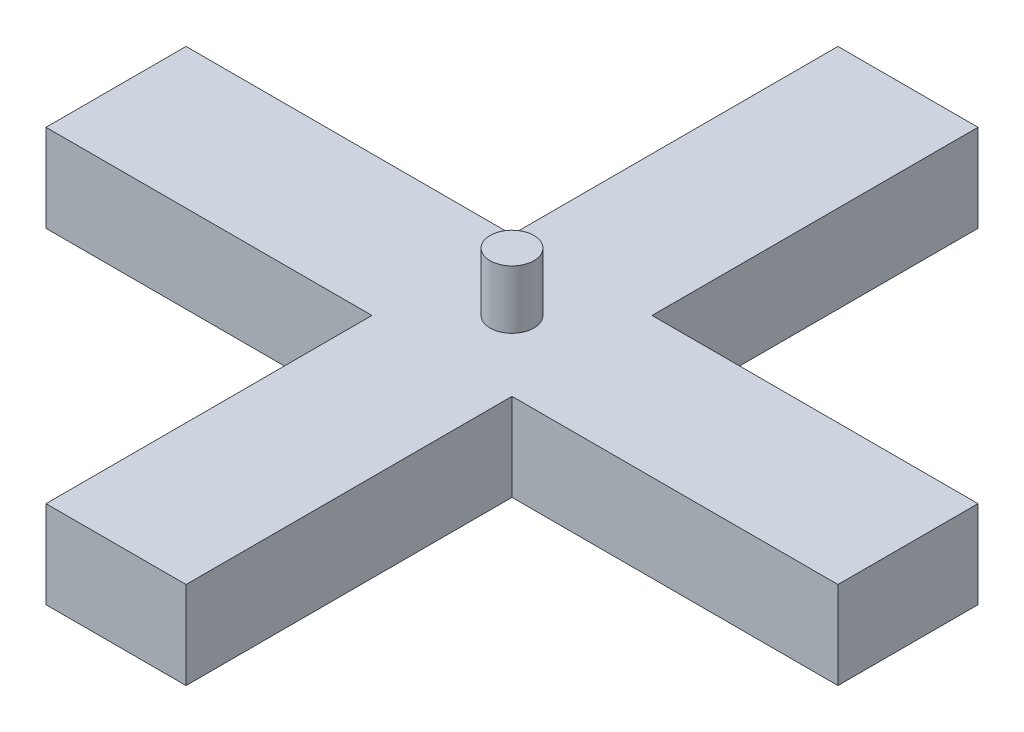
ISO-10303-21;
HEADER;
FILE_DESCRIPTION(('STEP AP214'),'2;1');
FILE_NAME('part.step','',(''),(''),'','','');
FILE_SCHEMA(('AUTOMOTIVE_DESIGN { 1 0 10303 214 1 1 1 1 }'));
ENDSEC;
DATA;
#1=APPLICATION_CONTEXT('core data for automotive mechanical design processes');
#2=APPLICATION_PROTOCOL_DEFINITION('international standard','automotive_design',2000,#1);
#3=PRODUCT_CONTEXT('',#1,'mechanical');
#4=PRODUCT('Part','Part','',(#3));
#5=PRODUCT_RELATED_PRODUCT_CATEGORY('part','',(#4));
#6=PRODUCT_DEFINITION_FORMATION('','',#4);
#7=PRODUCT_DEFINITION_CONTEXT('part definition',#1,'design');
#8=PRODUCT_DEFINITION('design','',#6,#7);
#9=PRODUCT_DEFINITION_SHAPE('','',#8);
#10=(LENGTH_UNIT() NAMED_UNIT(*) SI_UNIT(.MILLI.,.METRE.));
#11=(NAMED_UNIT(*) PLANE_ANGLE_UNIT() SI_UNIT($,.RADIAN.));
#12=(NAMED_UNIT(*) SI_UNIT($,.STERADIAN.) SOLID_ANGLE_UNIT());
#13=UNCERTAINTY_MEASURE_WITH_UNIT(LENGTH_MEASURE(1.E-05),#10,'distance_accuracy_value','');
#14=(GEOMETRIC_REPRESENTATION_CONTEXT(3) GLOBAL_UNCERTAINTY_ASSIGNED_CONTEXT((#13)) GLOBAL_UNIT_ASSIGNED_CONTEXT((#10,
#11,#12)) REPRESENTATION_CONTEXT('',''));
#15=CARTESIAN_POINT('',(0.,0.,0.));
#16=DIRECTION('',(0.,0.,1.));
#17=DIRECTION('',(1.,0.,0.));
#18=AXIS2_PLACEMENT_3D('',#15,#16,#17);
#19=CARTESIAN_POINT('',(-2.40562015503876,5.,5.51972868217054));
#20=DIRECTION('',(0.,-1.,0.));
#21=DIRECTION('',(0.,0.,-1.));
#22=AXIS2_PLACEMENT_3D('',#19,#20,#21);
#23=CYLINDRICAL_SURFACE('',#22,0.75);
#24=CARTESIAN_POINT('',(-2.40562015503876,3.,5.51972868217054));
#25=DIRECTION('',(0.,1.,0.));
#26=DIRECTION('',(0.,0.,1.));
#27=AXIS2_PLACEMENT_3D('',#24,#25,#26);
#28=CIRCLE('',#27,0.75);
#29=CARTESIAN_POINT('',(-2.40562015503876,3.,6.26972868217054));
#30=VERTEX_POINT('',#29);
#31=EDGE_CURVE('E155',#30,#30,#28,.T.);
#32=ORIENTED_EDGE('',*,*,#31,.T.);
#33=EDGE_LOOP('',(#32));
#34=FACE_BOUND('',#33,.T.);
#35=CARTESIAN_POINT('',(-2.40562015503876,5.,5.51972868217054));
#36=DIRECTION('',(0.,1.,0.));
#37=DIRECTION('',(0.,0.,1.));
#38=AXIS2_PLACEMENT_3D('',#35,#36,#37);
#39=CIRCLE('',#38,0.75);
#40=CARTESIAN_POINT('',(-2.40562015503876,5.,6.26972868217054));
#41=VERTEX_POINT('',#40);
#42=EDGE_CURVE('E11',#41,#41,#39,.T.);
#43=ORIENTED_EDGE('',*,*,#42,.F.);
#44=EDGE_LOOP('',(#43));
#45=FACE_BOUND('',#44,.T.);
#46=ADVANCED_FACE('F39',(#34,#45),#23,.T.);
#47=CARTESIAN_POINT('',(0.,5.,0.));
#48=DIRECTION('',(0.,1.,0.));
#49=DIRECTION('',(0.,0.,1.));
#50=AXIS2_PLACEMENT_3D('',#47,#48,#49);
#51=PLANE('',#50);
#52=ORIENTED_EDGE('',*,*,#42,.T.);
#53=EDGE_LOOP('',(#52));
#54=FACE_BOUND('',#53,.T.);
#55=ADVANCED_FACE('F220',(#54),#51,.T.);
#56=CARTESIAN_POINT('',(0.,3.,7.91972868217033));
#57=DIRECTION('',(0.,0.,1.));
#58=DIRECTION('',(1.,0.,0.));
#59=AXIS2_PLACEMENT_3D('',#56,#57,#58);
#60=PLANE('',#59);
#61=DIRECTION('',(-1.,0.,0.));
#62=VECTOR('',#61,1.);
#63=CARTESIAN_POINT('',(0.,0.,7.91972868217033));
#64=LINE('',#63,#62);
#65=CARTESIAN_POINT('',(-4.80562015503876,0.,7.91972868217032));
#66=VERTEX_POINT('',#65);
#67=CARTESIAN_POINT('',(-15.9756201550386,0.,7.91972868217028));
#68=VERTEX_POINT('',#67);
#69=EDGE_CURVE('E161',#66,#68,#64,.T.);
#70=ORIENTED_EDGE('',*,*,#69,.F.);
#71=DIRECTION('',(0.,-1.,0.));
#72=VECTOR('',#71,1.);
#73=CARTESIAN_POINT('',(-4.80562015503876,3.,7.91972868217032));
#74=LINE('',#73,#72);
#75=CARTESIAN_POINT('',(-4.80562015503876,3.,7.91972868217032));
#76=VERTEX_POINT('',#75);
#77=EDGE_CURVE('E47',#76,#66,#74,.T.);
#78=ORIENTED_EDGE('',*,*,#77,.F.);
#79=DIRECTION('',(-1.,0.,0.));
#80=VECTOR('',#79,1.);
#81=CARTESIAN_POINT('',(0.,3.,7.91972868217033));
#82=LINE('',#81,#80);
#83=CARTESIAN_POINT('',(-15.9756201550386,3.,7.91972868217028));
#84=VERTEX_POINT('',#83);
#85=EDGE_CURVE('E191',#76,#84,#82,.T.);
#86=ORIENTED_EDGE('',*,*,#85,.T.);
#87=DIRECTION('',(0.,-1.,0.));
#88=VECTOR('',#87,1.);
#89=CARTESIAN_POINT('',(-15.9756201550386,3.,7.91972868217028));
#90=LINE('',#89,#88);
#91=EDGE_CURVE('E103',#84,#68,#90,.T.);
#92=ORIENTED_EDGE('',*,*,#91,.T.);
#93=EDGE_LOOP('',(#70,#78,#86,#92));
#94=FACE_BOUND('',#93,.T.);
#95=ADVANCED_FACE('F218',(#94),#60,.T.);
#96=CARTESIAN_POINT('',(-4.80562015503876,3.,0.));
#97=DIRECTION('',(1.,0.,0.));
#98=DIRECTION('',(0.,0.,-1.));
#99=AXIS2_PLACEMENT_3D('',#96,#97,#98);
#100=PLANE('',#99);
#101=DIRECTION('',(0.,0.,1.));
#102=VECTOR('',#101,1.);
#103=CARTESIAN_POINT('',(-4.80562015503876,0.,0.));
#104=LINE('',#103,#102);
#105=CARTESIAN_POINT('',(-4.80562015503876,0.,19.0897286821705));
#106=VERTEX_POINT('',#105);
#107=EDGE_CURVE('E164',#66,#106,#104,.T.);
#108=ORIENTED_EDGE('',*,*,#107,.T.);
#109=DIRECTION('',(0.,-1.,0.));
#110=VECTOR('',#109,1.);
#111=CARTESIAN_POINT('',(-4.80562015503876,3.,19.0897286821705));
#112=LINE('',#111,#110);
#113=CARTESIAN_POINT('',(-4.80562015503876,3.,19.0897286821705));
#114=VERTEX_POINT('',#113);
#115=EDGE_CURVE('E207',#114,#106,#112,.T.);
#116=ORIENTED_EDGE('',*,*,#115,.F.);
#117=DIRECTION('',(0.,0.,1.));
#118=VECTOR('',#117,1.);
#119=CARTESIAN_POINT('',(-4.80562015503876,3.,0.));
#120=LINE('',#119,#118);
#121=EDGE_CURVE('E213',#76,#114,#120,.T.);
#122=ORIENTED_EDGE('',*,*,#121,.F.);
#123=ORIENTED_EDGE('',*,*,#77,.T.);
#124=EDGE_LOOP('',(#108,#116,#122,#123));
#125=FACE_BOUND('',#124,.T.);
#126=ADVANCED_FACE('F211',(#125),#100,.F.);
#127=CARTESIAN_POINT('',(0.,3.,19.0897286821705));
#128=DIRECTION('',(0.,0.,-1.));
#129=DIRECTION('',(-1.,0.,0.));
#130=AXIS2_PLACEMENT_3D('',#127,#128,#129);
#131=PLANE('',#130);
#132=DIRECTION('',(1.,0.,0.));
#133=VECTOR('',#132,1.);
#134=CARTESIAN_POINT('',(0.,0.,19.0897286821705));
#135=LINE('',#134,#133);
#136=CARTESIAN_POINT('',(-0.00562015503875919,0.,19.0897286821705));
#137=VERTEX_POINT('',#136);
#138=EDGE_CURVE('E166',#106,#137,#135,.T.);
#139=ORIENTED_EDGE('',*,*,#138,.T.);
#140=DIRECTION('',(0.,-1.,0.));
#141=VECTOR('',#140,1.);
#142=CARTESIAN_POINT('',(-0.00562015503875919,3.,19.0897286821705));
#143=LINE('',#142,#141);
#144=CARTESIAN_POINT('',(-0.00562015503875919,3.,19.0897286821705));
#145=VERTEX_POINT('',#144);
#146=EDGE_CURVE('E205',#145,#137,#143,.T.);
#147=ORIENTED_EDGE('',*,*,#146,.F.);
#148=DIRECTION('',(1.,0.,0.));
#149=VECTOR('',#148,1.);
#150=CARTESIAN_POINT('',(0.,3.,19.0897286821705));
#151=LINE('',#150,#149);
#152=EDGE_CURVE('E289',#114,#145,#151,.T.);
#153=ORIENTED_EDGE('',*,*,#152,.F.);
#154=ORIENTED_EDGE('',*,*,#115,.T.);
#155=EDGE_LOOP('',(#139,#147,#153,#154));
#156=FACE_BOUND('',#155,.T.);
#157=ADVANCED_FACE('F226',(#156),#131,.F.);
#158=CARTESIAN_POINT('',(-0.00562015503876224,3.,0.));
#159=DIRECTION('',(1.,0.,0.));
#160=DIRECTION('',(0.,0.,-1.));
#161=AXIS2_PLACEMENT_3D('',#158,#159,#160);
#162=PLANE('',#161);
#163=DIRECTION('',(0.,0.,1.));
#164=VECTOR('',#163,1.);
#165=CARTESIAN_POINT('',(-0.00562015503876224,0.,0.));
#166=LINE('',#165,#164);
#167=CARTESIAN_POINT('',(-0.00562015503876098,0.,7.91972868217032));
#168=VERTEX_POINT('',#167);
#169=EDGE_CURVE('E169',#168,#137,#166,.T.);
#170=ORIENTED_EDGE('',*,*,#169,.F.);
#171=DIRECTION('',(0.,-1.,0.));
#172=VECTOR('',#171,1.);
#173=CARTESIAN_POINT('',(-0.00562015503876098,3.,7.91972868217032));
#174=LINE('',#173,#172);
#175=CARTESIAN_POINT('',(-0.00562015503876098,3.,7.91972868217032));
#176=VERTEX_POINT('',#175);
#177=EDGE_CURVE('E203',#176,#168,#174,.T.);
#178=ORIENTED_EDGE('',*,*,#177,.F.);
#179=DIRECTION('',(0.,0.,1.));
#180=VECTOR('',#179,1.);
#181=CARTESIAN_POINT('',(-0.00562015503876224,3.,0.));
#182=LINE('',#181,#180);
#183=EDGE_CURVE('E285',#176,#145,#182,.T.);
#184=ORIENTED_EDGE('',*,*,#183,.T.);
#185=ORIENTED_EDGE('',*,*,#146,.T.);
#186=EDGE_LOOP('',(#170,#178,#184,#185));
#187=FACE_BOUND('',#186,.T.);
#188=ADVANCED_FACE('F270',(#187),#162,.T.);
#189=CARTESIAN_POINT('',(0.,3.,7.91972868217033));
#190=DIRECTION('',(0.,0.,1.));
#191=DIRECTION('',(1.,0.,0.));
#192=AXIS2_PLACEMENT_3D('',#189,#190,#191);
#193=PLANE('',#192);
#194=DIRECTION('',(-1.,0.,0.));
#195=VECTOR('',#194,1.);
#196=CARTESIAN_POINT('',(0.,0.,7.91972868217033));
#197=LINE('',#196,#195);
#198=CARTESIAN_POINT('',(11.1643798449614,0.,7.91972868217037));
#199=VERTEX_POINT('',#198);
#200=EDGE_CURVE('E172',#199,#168,#197,.T.);
#201=ORIENTED_EDGE('',*,*,#200,.F.);
#202=DIRECTION('',(0.,-1.,0.));
#203=VECTOR('',#202,1.);
#204=CARTESIAN_POINT('',(11.1643798449614,3.,7.91972868217037));
#205=LINE('',#204,#203);
#206=CARTESIAN_POINT('',(11.1643798449614,3.,7.91972868217037));
#207=VERTEX_POINT('',#206);
#208=EDGE_CURVE('E201',#207,#199,#205,.T.);
#209=ORIENTED_EDGE('',*,*,#208,.F.);
#210=DIRECTION('',(-1.,0.,0.));
#211=VECTOR('',#210,1.);
#212=CARTESIAN_POINT('',(0.,3.,7.91972868217033));
#213=LINE('',#212,#211);
#214=EDGE_CURVE('E288',#207,#176,#213,.T.);
#215=ORIENTED_EDGE('',*,*,#214,.T.);
#216=ORIENTED_EDGE('',*,*,#177,.T.);
#217=EDGE_LOOP('',(#201,#209,#215,#216));
#218=FACE_BOUND('',#217,.T.);
#219=ADVANCED_FACE('F266',(#218),#193,.T.);
#220=CARTESIAN_POINT('',(11.1643798449614,3.,0.));
#221=DIRECTION('',(1.,0.,0.));
#222=DIRECTION('',(0.,0.,-1.));
#223=AXIS2_PLACEMENT_3D('',#220,#221,#222);
#224=PLANE('',#223);
#225=DIRECTION('',(0.,0.,1.));
#226=VECTOR('',#225,1.);
#227=CARTESIAN_POINT('',(11.1643798449614,0.,0.));
#228=LINE('',#227,#226);
#229=CARTESIAN_POINT('',(11.1643798449614,0.,3.11972868217037));
#230=VERTEX_POINT('',#229);
#231=EDGE_CURVE('E175',#230,#199,#228,.T.);
#232=ORIENTED_EDGE('',*,*,#231,.F.);
#233=DIRECTION('',(0.,-1.,0.));
#234=VECTOR('',#233,1.);
#235=CARTESIAN_POINT('',(11.1643798449614,3.,3.11972868217037));
#236=LINE('',#235,#234);
#237=CARTESIAN_POINT('',(11.1643798449614,3.,3.11972868217037));
#238=VERTEX_POINT('',#237);
#239=EDGE_CURVE('E199',#238,#230,#236,.T.);
#240=ORIENTED_EDGE('',*,*,#239,.F.);
#241=DIRECTION('',(0.,0.,1.));
#242=VECTOR('',#241,1.);
#243=CARTESIAN_POINT('',(11.1643798449614,3.,0.));
#244=LINE('',#243,#242);
#245=EDGE_CURVE('E291',#238,#207,#244,.T.);
#246=ORIENTED_EDGE('',*,*,#245,.T.);
#247=ORIENTED_EDGE('',*,*,#208,.T.);
#248=EDGE_LOOP('',(#232,#240,#246,#247));
#249=FACE_BOUND('',#248,.T.);
#250=ADVANCED_FACE('F262',(#249),#224,.T.);
#251=CARTESIAN_POINT('',(0.,3.,3.11972868217033));
#252=DIRECTION('',(0.,0.,1.));
#253=DIRECTION('',(1.,0.,0.));
#254=AXIS2_PLACEMENT_3D('',#251,#252,#253);
#255=PLANE('',#254);
#256=DIRECTION('',(-1.,0.,0.));
#257=VECTOR('',#256,1.);
#258=CARTESIAN_POINT('',(0.,0.,3.11972868217033));
#259=LINE('',#258,#257);
#260=CARTESIAN_POINT('',(-0.00562015503876174,0.,3.11972868217032));
#261=VERTEX_POINT('',#260);
#262=EDGE_CURVE('E178',#230,#261,#259,.T.);
#263=ORIENTED_EDGE('',*,*,#262,.T.);
#264=DIRECTION('',(0.,-1.,0.));
#265=VECTOR('',#264,1.);
#266=CARTESIAN_POINT('',(-0.00562015503876174,3.,3.11972868217032));
#267=LINE('',#266,#265);
#268=CARTESIAN_POINT('',(-0.00562015503876174,3.,3.11972868217032));
#269=VERTEX_POINT('',#268);
#270=EDGE_CURVE('E197',#269,#261,#267,.T.);
#271=ORIENTED_EDGE('',*,*,#270,.F.);
#272=DIRECTION('',(-1.,0.,0.));
#273=VECTOR('',#272,1.);
#274=CARTESIAN_POINT('',(0.,3.,3.11972868217033));
#275=LINE('',#274,#273);
#276=EDGE_CURVE('E298',#238,#269,#275,.T.);
#277=ORIENTED_EDGE('',*,*,#276,.F.);
#278=ORIENTED_EDGE('',*,*,#239,.T.);
#279=EDGE_LOOP('',(#263,#271,#277,#278));
#280=FACE_BOUND('',#279,.T.);
#281=ADVANCED_FACE('F258',(#280),#255,.F.);
#282=CARTESIAN_POINT('',(-0.00562015503876224,3.,0.));
#283=DIRECTION('',(1.,0.,0.));
#284=DIRECTION('',(0.,0.,-1.));
#285=AXIS2_PLACEMENT_3D('',#282,#283,#284);
#286=PLANE('',#285);
#287=DIRECTION('',(0.,0.,1.));
#288=VECTOR('',#287,1.);
#289=CARTESIAN_POINT('',(-0.00562015503876224,0.,0.));
#290=LINE('',#289,#288);
#291=CARTESIAN_POINT('',(-0.00562015503876353,0.,-8.05027131782946));
#292=VERTEX_POINT('',#291);
#293=EDGE_CURVE('E181',#292,#261,#290,.T.);
#294=ORIENTED_EDGE('',*,*,#293,.F.);
#295=DIRECTION('',(0.,-1.,0.));
#296=VECTOR('',#295,1.);
#297=CARTESIAN_POINT('',(-0.00562015503876353,3.,-8.05027131782946));
#298=LINE('',#297,#296);
#299=CARTESIAN_POINT('',(-0.00562015503876353,3.,-8.05027131782946));
#300=VERTEX_POINT('',#299);
#301=EDGE_CURVE('E195',#300,#292,#298,.T.);
#302=ORIENTED_EDGE('',*,*,#301,.F.);
#303=DIRECTION('',(0.,0.,1.));
#304=VECTOR('',#303,1.);
#305=CARTESIAN_POINT('',(-0.00562015503876224,3.,0.));
#306=LINE('',#305,#304);
#307=EDGE_CURVE('E300',#300,#269,#306,.T.);
#308=ORIENTED_EDGE('',*,*,#307,.T.);
#309=ORIENTED_EDGE('',*,*,#270,.T.);
#310=EDGE_LOOP('',(#294,#302,#308,#309));
#311=FACE_BOUND('',#310,.T.);
#312=ADVANCED_FACE('F254',(#311),#286,.T.);
#313=CARTESIAN_POINT('',(0.,3.,-8.05027131782946));
#314=DIRECTION('',(0.,0.,-1.));
#315=DIRECTION('',(-1.,0.,0.));
#316=AXIS2_PLACEMENT_3D('',#313,#314,#315);
#317=PLANE('',#316);
#318=DIRECTION('',(1.,0.,0.));
#319=VECTOR('',#318,1.);
#320=CARTESIAN_POINT('',(0.,0.,-8.05027131782946));
#321=LINE('',#320,#319);
#322=CARTESIAN_POINT('',(-4.80562015503876,0.,-8.05027131782946));
#323=VERTEX_POINT('',#322);
#324=EDGE_CURVE('E184',#323,#292,#321,.T.);
#325=ORIENTED_EDGE('',*,*,#324,.F.);
#326=DIRECTION('',(0.,-1.,0.));
#327=VECTOR('',#326,1.);
#328=CARTESIAN_POINT('',(-4.80562015503876,3.,-8.05027131782946));
#329=LINE('',#328,#327);
#330=CARTESIAN_POINT('',(-4.80562015503876,3.,-8.05027131782946));
#331=VERTEX_POINT('',#330);
#332=EDGE_CURVE('E150',#331,#323,#329,.T.);
#333=ORIENTED_EDGE('',*,*,#332,.F.);
#334=DIRECTION('',(1.,0.,0.));
#335=VECTOR('',#334,1.);
#336=CARTESIAN_POINT('',(0.,3.,-8.05027131782946));
#337=LINE('',#336,#335);
#338=EDGE_CURVE('E143',#331,#300,#337,.T.);
#339=ORIENTED_EDGE('',*,*,#338,.T.);
#340=ORIENTED_EDGE('',*,*,#301,.T.);
#341=EDGE_LOOP('',(#325,#333,#339,#340));
#342=FACE_BOUND('',#341,.T.);
#343=ADVANCED_FACE('F251',(#342),#317,.T.);
#344=CARTESIAN_POINT('',(-4.80562015503876,3.,0.));
#345=DIRECTION('',(1.,0.,0.));
#346=DIRECTION('',(0.,0.,-1.));
#347=AXIS2_PLACEMENT_3D('',#344,#345,#346);
#348=PLANE('',#347);
#349=DIRECTION('',(0.,0.,1.));
#350=VECTOR('',#349,1.);
#351=CARTESIAN_POINT('',(-4.80562015503876,0.,0.));
#352=LINE('',#351,#350);
#353=CARTESIAN_POINT('',(-4.80562015503876,0.,3.11972868217032));
#354=VERTEX_POINT('',#353);
#355=EDGE_CURVE('E149',#323,#354,#352,.T.);
#356=ORIENTED_EDGE('',*,*,#355,.T.);
#357=DIRECTION('',(0.,-1.,0.));
#358=VECTOR('',#357,1.);
#359=CARTESIAN_POINT('',(-4.80562015503876,3.,3.11972868217032));
#360=LINE('',#359,#358);
#361=CARTESIAN_POINT('',(-4.80562015503876,3.,3.11972868217032));
#362=VERTEX_POINT('',#361);
#363=EDGE_CURVE('E146',#362,#354,#360,.T.);
#364=ORIENTED_EDGE('',*,*,#363,.F.);
#365=DIRECTION('',(0.,0.,1.));
#366=VECTOR('',#365,1.);
#367=CARTESIAN_POINT('',(-4.80562015503876,3.,0.));
#368=LINE('',#367,#366);
#369=EDGE_CURVE('E135',#331,#362,#368,.T.);
#370=ORIENTED_EDGE('',*,*,#369,.F.);
#371=ORIENTED_EDGE('',*,*,#332,.T.);
#372=EDGE_LOOP('',(#356,#364,#370,#371));
#373=FACE_BOUND('',#372,.T.);
#374=ADVANCED_FACE('F147',(#373),#348,.F.);
#375=CARTESIAN_POINT('',(0.,3.,3.11972868217033));
#376=DIRECTION('',(0.,0.,1.));
#377=DIRECTION('',(1.,0.,0.));
#378=AXIS2_PLACEMENT_3D('',#375,#376,#377);
#379=PLANE('',#378);
#380=DIRECTION('',(-1.,0.,0.));
#381=VECTOR('',#380,1.);
#382=CARTESIAN_POINT('',(0.,0.,3.11972868217033));
#383=LINE('',#382,#381);
#384=CARTESIAN_POINT('',(-15.9756201550386,0.,3.11972868217028));
#385=VERTEX_POINT('',#384);
#386=EDGE_CURVE('E96',#354,#385,#383,.T.);
#387=ORIENTED_EDGE('',*,*,#386,.T.);
#388=DIRECTION('',(0.,-1.,0.));
#389=VECTOR('',#388,1.);
#390=CARTESIAN_POINT('',(-15.9756201550386,3.,3.11972868217028));
#391=LINE('',#390,#389);
#392=CARTESIAN_POINT('',(-15.9756201550386,3.,3.11972868217028));
#393=VERTEX_POINT('',#392);
#394=EDGE_CURVE('E151',#393,#385,#391,.T.);
#395=ORIENTED_EDGE('',*,*,#394,.F.);
#396=DIRECTION('',(-1.,0.,0.));
#397=VECTOR('',#396,1.);
#398=CARTESIAN_POINT('',(0.,3.,3.11972868217033));
#399=LINE('',#398,#397);
#400=EDGE_CURVE('E140',#362,#393,#399,.T.);
#401=ORIENTED_EDGE('',*,*,#400,.F.);
#402=ORIENTED_EDGE('',*,*,#363,.T.);
#403=EDGE_LOOP('',(#387,#395,#401,#402));
#404=FACE_BOUND('',#403,.T.);
#405=ADVANCED_FACE('F153',(#404),#379,.F.);
#406=CARTESIAN_POINT('',(-15.9756201550386,3.,0.));
#407=DIRECTION('',(1.,0.,0.));
#408=DIRECTION('',(0.,0.,-1.));
#409=AXIS2_PLACEMENT_3D('',#406,#407,#408);
#410=PLANE('',#409);
#411=DIRECTION('',(0.,0.,1.));
#412=VECTOR('',#411,1.);
#413=CARTESIAN_POINT('',(-15.9756201550386,0.,0.));
#414=LINE('',#413,#412);
#415=EDGE_CURVE('E189',#385,#68,#414,.T.);
#416=ORIENTED_EDGE('',*,*,#415,.T.);
#417=ORIENTED_EDGE('',*,*,#91,.F.);
#418=DIRECTION('',(0.,0.,1.));
#419=VECTOR('',#418,1.);
#420=CARTESIAN_POINT('',(-15.9756201550386,3.,0.));
#421=LINE('',#420,#419);
#422=EDGE_CURVE('E55',#393,#84,#421,.T.);
#423=ORIENTED_EDGE('',*,*,#422,.F.);
#424=ORIENTED_EDGE('',*,*,#394,.T.);
#425=EDGE_LOOP('',(#416,#417,#423,#424));
#426=FACE_BOUND('',#425,.T.);
#427=ADVANCED_FACE('F238',(#426),#410,.F.);
#428=CARTESIAN_POINT('',(0.,3.,0.));
#429=DIRECTION('',(0.,1.,0.));
#430=DIRECTION('',(0.,0.,1.));
#431=AXIS2_PLACEMENT_3D('',#428,#429,#430);
#432=PLANE('',#431);
#433=ORIENTED_EDGE('',*,*,#85,.F.);
#434=ORIENTED_EDGE('',*,*,#121,.T.);
#435=ORIENTED_EDGE('',*,*,#152,.T.);
#436=ORIENTED_EDGE('',*,*,#183,.F.);
#437=ORIENTED_EDGE('',*,*,#214,.F.);
#438=ORIENTED_EDGE('',*,*,#245,.F.);
#439=ORIENTED_EDGE('',*,*,#276,.T.);
#440=ORIENTED_EDGE('',*,*,#307,.F.);
#441=ORIENTED_EDGE('',*,*,#338,.F.);
#442=ORIENTED_EDGE('',*,*,#369,.T.);
#443=ORIENTED_EDGE('',*,*,#400,.T.);
#444=ORIENTED_EDGE('',*,*,#422,.T.);
#445=EDGE_LOOP('',(#433,#434,#435,#436,#437,#438,#439,#440,#441,#442,#443,#444));
#446=FACE_BOUND('',#445,.T.);
#447=ORIENTED_EDGE('',*,*,#31,.F.);
#448=EDGE_LOOP('',(#447));
#449=FACE_BOUND('',#448,.T.);
#450=ADVANCED_FACE('F137',(#446,#449),#432,.T.);
#451=CARTESIAN_POINT('',(0.,0.,0.));
#452=DIRECTION('',(0.,1.,0.));
#453=DIRECTION('',(0.,0.,1.));
#454=AXIS2_PLACEMENT_3D('',#451,#452,#453);
#455=PLANE('',#454);
#456=ORIENTED_EDGE('',*,*,#69,.T.);
#457=ORIENTED_EDGE('',*,*,#415,.F.);
#458=ORIENTED_EDGE('',*,*,#386,.F.);
#459=ORIENTED_EDGE('',*,*,#355,.F.);
#460=ORIENTED_EDGE('',*,*,#324,.T.);
#461=ORIENTED_EDGE('',*,*,#293,.T.);
#462=ORIENTED_EDGE('',*,*,#262,.F.);
#463=ORIENTED_EDGE('',*,*,#231,.T.);
#464=ORIENTED_EDGE('',*,*,#200,.T.);
#465=ORIENTED_EDGE('',*,*,#169,.T.);
#466=ORIENTED_EDGE('',*,*,#138,.F.);
#467=ORIENTED_EDGE('',*,*,#107,.F.);
#468=EDGE_LOOP('',(#456,#457,#458,#459,#460,#461,#462,#463,#464,#465,#466,#467));
#469=FACE_BOUND('',#468,.T.);
#470=ADVANCED_FACE('F216',(#469),#455,.F.);
#471=CLOSED_SHELL('',(#46,#55,#95,#126,#157,#188,#219,#250,#281,#312,#343,#374,#405,#427,#450,#470));
#472=MANIFOLD_SOLID_BREP('B2',#471);
#473=ADVANCED_BREP_SHAPE_REPRESENTATION('',(#18,#472),#14);
#474=SHAPE_DEFINITION_REPRESENTATION(#9,#473);
ENDSEC;
END-ISO-10303-21;
